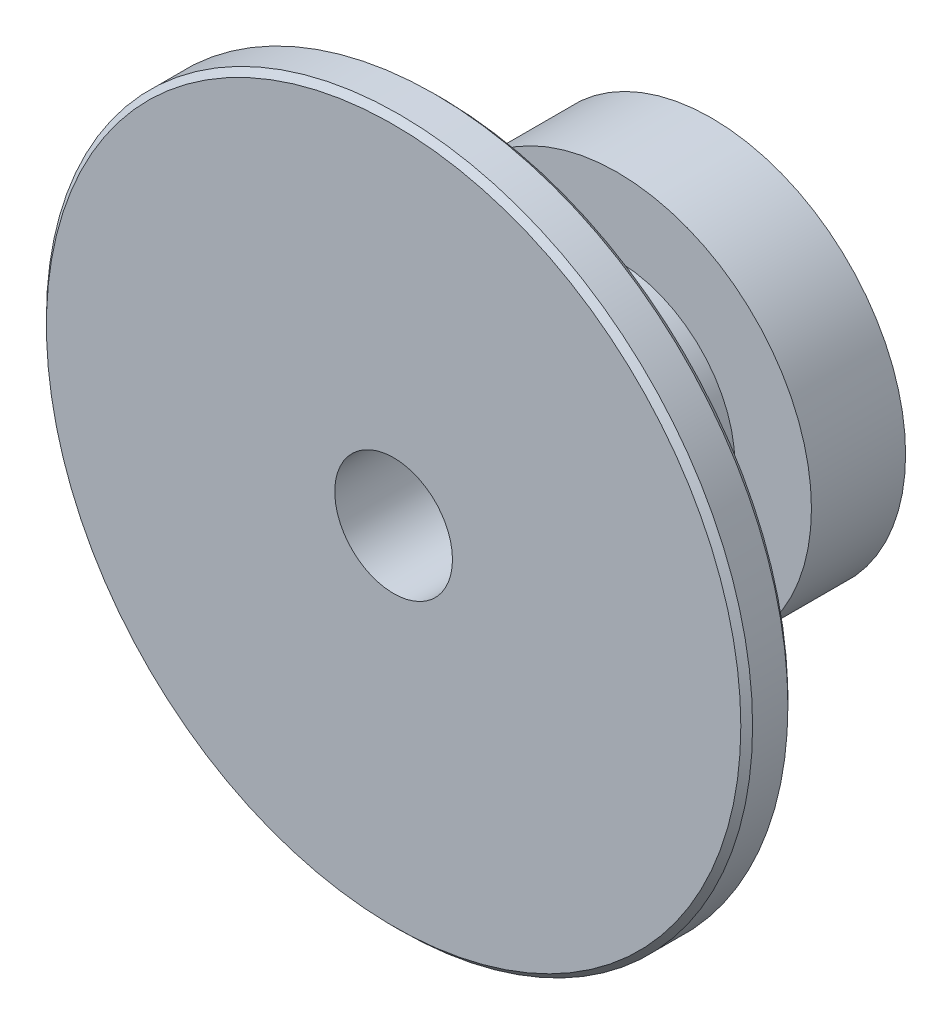
ISO-10303-21;
HEADER;
FILE_DESCRIPTION(('STEP AP214'),'2;1');
FILE_NAME('part.step','',(''),(''),'','','');
FILE_SCHEMA(('AUTOMOTIVE_DESIGN { 1 0 10303 214 1 1 1 1 }'));
ENDSEC;
DATA;
#1=APPLICATION_CONTEXT('core data for automotive mechanical design processes');
#2=APPLICATION_PROTOCOL_DEFINITION('international standard','automotive_design',2000,#1);
#3=PRODUCT_CONTEXT('',#1,'mechanical');
#4=PRODUCT('Part','Part','',(#3));
#5=PRODUCT_RELATED_PRODUCT_CATEGORY('part','',(#4));
#6=PRODUCT_DEFINITION_FORMATION('','',#4);
#7=PRODUCT_DEFINITION_CONTEXT('part definition',#1,'design');
#8=PRODUCT_DEFINITION('design','',#6,#7);
#9=PRODUCT_DEFINITION_SHAPE('','',#8);
#10=(LENGTH_UNIT() NAMED_UNIT(*) SI_UNIT(.MILLI.,.METRE.));
#11=(NAMED_UNIT(*) PLANE_ANGLE_UNIT() SI_UNIT($,.RADIAN.));
#12=(NAMED_UNIT(*) SI_UNIT($,.STERADIAN.) SOLID_ANGLE_UNIT());
#13=UNCERTAINTY_MEASURE_WITH_UNIT(LENGTH_MEASURE(1.E-05),#10,'distance_accuracy_value','');
#14=(GEOMETRIC_REPRESENTATION_CONTEXT(3) GLOBAL_UNCERTAINTY_ASSIGNED_CONTEXT((#13)) GLOBAL_UNIT_ASSIGNED_CONTEXT((#10,
#11,#12)) REPRESENTATION_CONTEXT('',''));
#15=CARTESIAN_POINT('',(0.,0.,0.));
#16=DIRECTION('',(0.,0.,1.));
#17=DIRECTION('',(1.,0.,0.));
#18=AXIS2_PLACEMENT_3D('',#15,#16,#17);
#19=CARTESIAN_POINT('',(0.,0.,17.8725165562914));
#20=DIRECTION('',(0.,0.,1.));
#21=DIRECTION('',(1.,0.,0.));
#22=AXIS2_PLACEMENT_3D('',#19,#20,#21);
#23=CYLINDRICAL_SURFACE('',#22,15.);
#24=CARTESIAN_POINT('',(0.,0.,-0.250000000000011));
#25=DIRECTION('',(0.,0.,1.));
#26=DIRECTION('',(1.,0.,0.));
#27=AXIS2_PLACEMENT_3D('',#24,#25,#26);
#28=CIRCLE('',#27,15.);
#29=CARTESIAN_POINT('',(15.,0.,-0.250000000000011));
#30=VERTEX_POINT('',#29);
#31=EDGE_CURVE('E40',#30,#30,#28,.F.);
#32=ORIENTED_EDGE('',*,*,#31,.T.);
#33=EDGE_LOOP('',(#32));
#34=FACE_BOUND('',#33,.T.);
#35=CARTESIAN_POINT('',(0.,0.,-1.75000000000001));
#36=DIRECTION('',(0.,0.,-1.));
#37=DIRECTION('',(-1.,0.,0.));
#38=AXIS2_PLACEMENT_3D('',#35,#36,#37);
#39=CIRCLE('',#38,15.);
#40=CARTESIAN_POINT('',(-15.,0.,-1.75000000000001));
#41=VERTEX_POINT('',#40);
#42=EDGE_CURVE('E44',#41,#41,#39,.F.);
#43=ORIENTED_EDGE('',*,*,#42,.T.);
#44=EDGE_LOOP('',(#43));
#45=FACE_BOUND('',#44,.T.);
#46=ADVANCED_FACE('F29',(#34,#45),#23,.T.);
#47=CARTESIAN_POINT('',(6.,0.,0.));
#48=DIRECTION('',(0.,0.,1.));
#49=DIRECTION('',(1.,0.,0.));
#50=AXIS2_PLACEMENT_3D('',#47,#48,#49);
#51=PLANE('',#50);
#52=CARTESIAN_POINT('',(0.,0.,0.));
#53=DIRECTION('',(0.,0.,1.));
#54=DIRECTION('',(1.,0.,0.));
#55=AXIS2_PLACEMENT_3D('',#52,#53,#54);
#56=CIRCLE('',#55,2.5);
#57=CARTESIAN_POINT('',(2.5,0.,0.));
#58=VERTEX_POINT('',#57);
#59=EDGE_CURVE('E58',#58,#58,#56,.T.);
#60=ORIENTED_EDGE('',*,*,#59,.F.);
#61=EDGE_LOOP('',(#60));
#62=FACE_BOUND('',#61,.T.);
#63=CARTESIAN_POINT('',(0.,0.,0.));
#64=DIRECTION('',(0.,0.,1.));
#65=DIRECTION('',(1.,0.,0.));
#66=AXIS2_PLACEMENT_3D('',#63,#64,#65);
#67=CIRCLE('',#66,14.75);
#68=CARTESIAN_POINT('',(14.75,0.,0.));
#69=VERTEX_POINT('',#68);
#70=EDGE_CURVE('E49',#69,#69,#67,.T.);
#71=ORIENTED_EDGE('',*,*,#70,.T.);
#72=EDGE_LOOP('',(#71));
#73=FACE_BOUND('',#72,.T.);
#74=ADVANCED_FACE('F90',(#62,#73),#51,.T.);
#75=CARTESIAN_POINT('',(0.,0.,-6.5));
#76=DIRECTION('',(0.,0.,-1.));
#77=DIRECTION('',(-1.,0.,0.));
#78=AXIS2_PLACEMENT_3D('',#75,#76,#77);
#79=PLANE('',#78);
#80=CARTESIAN_POINT('',(0.,0.,-6.5));
#81=DIRECTION('',(0.,0.,-1.));
#82=DIRECTION('',(-1.,0.,0.));
#83=AXIS2_PLACEMENT_3D('',#80,#81,#82);
#84=CIRCLE('',#83,5.);
#85=CARTESIAN_POINT('',(-5.,0.,-6.5));
#86=VERTEX_POINT('',#85);
#87=EDGE_CURVE('E10',#86,#86,#84,.T.);
#88=ORIENTED_EDGE('',*,*,#87,.F.);
#89=EDGE_LOOP('',(#88));
#90=FACE_BOUND('',#89,.T.);
#91=CARTESIAN_POINT('',(0.,0.,-6.5));
#92=DIRECTION('',(0.,0.,1.));
#93=DIRECTION('',(1.,0.,0.));
#94=AXIS2_PLACEMENT_3D('',#91,#92,#93);
#95=CIRCLE('',#94,8.25);
#96=CARTESIAN_POINT('',(8.25,0.,-6.5));
#97=VERTEX_POINT('',#96);
#98=EDGE_CURVE('E52',#97,#97,#95,.T.);
#99=ORIENTED_EDGE('',*,*,#98,.F.);
#100=EDGE_LOOP('',(#99));
#101=FACE_BOUND('',#100,.T.);
#102=ADVANCED_FACE('F96',(#90,#101),#79,.T.);
#103=CARTESIAN_POINT('',(0.,0.,17.8725165562914));
#104=DIRECTION('',(0.,0.,1.));
#105=DIRECTION('',(1.,0.,0.));
#106=AXIS2_PLACEMENT_3D('',#103,#104,#105);
#107=CYLINDRICAL_SURFACE('',#106,8.25);
#108=ORIENTED_EDGE('',*,*,#98,.T.);
#109=EDGE_LOOP('',(#108));
#110=FACE_BOUND('',#109,.T.);
#111=CARTESIAN_POINT('',(0.,0.,-2.));
#112=DIRECTION('',(0.,0.,1.));
#113=DIRECTION('',(1.,0.,0.));
#114=AXIS2_PLACEMENT_3D('',#111,#112,#113);
#115=CIRCLE('',#114,8.25);
#116=CARTESIAN_POINT('',(8.25,0.,-2.));
#117=VERTEX_POINT('',#116);
#118=EDGE_CURVE('E55',#117,#117,#115,.T.);
#119=ORIENTED_EDGE('',*,*,#118,.F.);
#120=EDGE_LOOP('',(#119));
#121=FACE_BOUND('',#120,.T.);
#122=ADVANCED_FACE('F111',(#110,#121),#107,.T.);
#123=CARTESIAN_POINT('',(15.,0.,-2.));
#124=DIRECTION('',(0.,0.,-1.));
#125=DIRECTION('',(-1.,0.,0.));
#126=AXIS2_PLACEMENT_3D('',#123,#124,#125);
#127=PLANE('',#126);
#128=CARTESIAN_POINT('',(0.,0.,-2.));
#129=DIRECTION('',(0.,0.,-1.));
#130=DIRECTION('',(-1.,0.,0.));
#131=AXIS2_PLACEMENT_3D('',#128,#129,#130);
#132=CIRCLE('',#131,14.75);
#133=CARTESIAN_POINT('',(-14.75,0.,-2.));
#134=VERTEX_POINT('',#133);
#135=EDGE_CURVE('E36',#134,#134,#132,.T.);
#136=ORIENTED_EDGE('',*,*,#135,.T.);
#137=EDGE_LOOP('',(#136));
#138=FACE_BOUND('',#137,.T.);
#139=ORIENTED_EDGE('',*,*,#118,.T.);
#140=EDGE_LOOP('',(#139));
#141=FACE_BOUND('',#140,.T.);
#142=ADVANCED_FACE('F103',(#138,#141),#127,.T.);
#143=CARTESIAN_POINT('',(0.,0.,0.));
#144=DIRECTION('',(0.,0.,-1.));
#145=DIRECTION('',(-1.,0.,0.));
#146=AXIS2_PLACEMENT_3D('',#143,#144,#145);
#147=CONICAL_SURFACE('',#146,14.75,0.785398163397448);
#148=ORIENTED_EDGE('',*,*,#31,.F.);
#149=EDGE_LOOP('',(#148));
#150=FACE_BOUND('',#149,.T.);
#151=ORIENTED_EDGE('',*,*,#70,.F.);
#152=EDGE_LOOP('',(#151));
#153=FACE_BOUND('',#152,.T.);
#154=ADVANCED_FACE('F101',(#150,#153),#147,.T.);
#155=CARTESIAN_POINT('',(0.,0.,-1.75000000000001));
#156=DIRECTION('',(0.,0.,1.));
#157=DIRECTION('',(1.,0.,0.));
#158=AXIS2_PLACEMENT_3D('',#155,#156,#157);
#159=CONICAL_SURFACE('',#158,15.,0.785398163397452);
#160=ORIENTED_EDGE('',*,*,#135,.F.);
#161=EDGE_LOOP('',(#160));
#162=FACE_BOUND('',#161,.T.);
#163=ORIENTED_EDGE('',*,*,#42,.F.);
#164=EDGE_LOOP('',(#163));
#165=FACE_BOUND('',#164,.T.);
#166=ADVANCED_FACE('F31',(#162,#165),#159,.T.);
#167=CARTESIAN_POINT('',(0.,0.,3.5));
#168=DIRECTION('',(0.,0.,-1.));
#169=DIRECTION('',(-1.,0.,0.));
#170=AXIS2_PLACEMENT_3D('',#167,#168,#169);
#171=CYLINDRICAL_SURFACE('',#170,2.5);
#172=ORIENTED_EDGE('',*,*,#59,.T.);
#173=EDGE_LOOP('',(#172));
#174=FACE_BOUND('',#173,.T.);
#175=CARTESIAN_POINT('',(0.,0.,-13.5));
#176=DIRECTION('',(0.,0.,1.));
#177=DIRECTION('',(1.,0.,0.));
#178=AXIS2_PLACEMENT_3D('',#175,#176,#177);
#179=CIRCLE('',#178,2.5);
#180=CARTESIAN_POINT('',(2.5,0.,-13.5));
#181=VERTEX_POINT('',#180);
#182=EDGE_CURVE('E61',#181,#181,#179,.T.);
#183=ORIENTED_EDGE('',*,*,#182,.F.);
#184=EDGE_LOOP('',(#183));
#185=FACE_BOUND('',#184,.T.);
#186=ADVANCED_FACE('F109',(#174,#185),#171,.F.);
#187=CARTESIAN_POINT('',(2.5,0.,-13.5));
#188=DIRECTION('',(0.,0.,-1.));
#189=DIRECTION('',(-1.,0.,0.));
#190=AXIS2_PLACEMENT_3D('',#187,#188,#189);
#191=PLANE('',#190);
#192=ORIENTED_EDGE('',*,*,#182,.T.);
#193=EDGE_LOOP('',(#192));
#194=FACE_BOUND('',#193,.T.);
#195=CARTESIAN_POINT('',(0.,0.,-13.5));
#196=DIRECTION('',(0.,0.,1.));
#197=DIRECTION('',(1.,0.,0.));
#198=AXIS2_PLACEMENT_3D('',#195,#196,#197);
#199=CIRCLE('',#198,8.25);
#200=CARTESIAN_POINT('',(8.25,0.,-13.5));
#201=VERTEX_POINT('',#200);
#202=EDGE_CURVE('E64',#201,#201,#199,.T.);
#203=ORIENTED_EDGE('',*,*,#202,.F.);
#204=EDGE_LOOP('',(#203));
#205=FACE_BOUND('',#204,.T.);
#206=ADVANCED_FACE('F86',(#194,#205),#191,.T.);
#207=CARTESIAN_POINT('',(0.,0.,0.));
#208=DIRECTION('',(0.,0.,1.));
#209=DIRECTION('',(1.,0.,0.));
#210=AXIS2_PLACEMENT_3D('',#207,#208,#209);
#211=CYLINDRICAL_SURFACE('',#210,8.25);
#212=ORIENTED_EDGE('',*,*,#202,.T.);
#213=EDGE_LOOP('',(#212));
#214=FACE_BOUND('',#213,.T.);
#215=CARTESIAN_POINT('',(0.,0.,-9.5));
#216=DIRECTION('',(0.,0.,1.));
#217=DIRECTION('',(1.,0.,0.));
#218=AXIS2_PLACEMENT_3D('',#215,#216,#217);
#219=CIRCLE('',#218,8.25);
#220=CARTESIAN_POINT('',(8.25,0.,-9.5));
#221=VERTEX_POINT('',#220);
#222=EDGE_CURVE('E67',#221,#221,#219,.T.);
#223=ORIENTED_EDGE('',*,*,#222,.F.);
#224=EDGE_LOOP('',(#223));
#225=FACE_BOUND('',#224,.T.);
#226=ADVANCED_FACE('F78',(#214,#225),#211,.T.);
#227=CARTESIAN_POINT('',(8.25,0.,-9.5));
#228=DIRECTION('',(0.,0.,1.));
#229=DIRECTION('',(1.,0.,0.));
#230=AXIS2_PLACEMENT_3D('',#227,#228,#229);
#231=PLANE('',#230);
#232=ORIENTED_EDGE('',*,*,#222,.T.);
#233=EDGE_LOOP('',(#232));
#234=FACE_BOUND('',#233,.T.);
#235=CARTESIAN_POINT('',(0.,0.,-9.5));
#236=DIRECTION('',(0.,0.,1.));
#237=DIRECTION('',(1.,0.,0.));
#238=AXIS2_PLACEMENT_3D('',#235,#236,#237);
#239=CIRCLE('',#238,5.);
#240=CARTESIAN_POINT('',(5.,0.,-9.5));
#241=VERTEX_POINT('',#240);
#242=EDGE_CURVE('E70',#241,#241,#239,.T.);
#243=ORIENTED_EDGE('',*,*,#242,.F.);
#244=EDGE_LOOP('',(#243));
#245=FACE_BOUND('',#244,.T.);
#246=ADVANCED_FACE('F76',(#234,#245),#231,.T.);
#247=CARTESIAN_POINT('',(0.,0.,0.));
#248=DIRECTION('',(0.,0.,1.));
#249=DIRECTION('',(1.,0.,0.));
#250=AXIS2_PLACEMENT_3D('',#247,#248,#249);
#251=CYLINDRICAL_SURFACE('',#250,5.);
#252=ORIENTED_EDGE('',*,*,#87,.T.);
#253=EDGE_LOOP('',(#252));
#254=FACE_BOUND('',#253,.T.);
#255=ORIENTED_EDGE('',*,*,#242,.T.);
#256=EDGE_LOOP('',(#255));
#257=FACE_BOUND('',#256,.T.);
#258=ADVANCED_FACE('F74',(#254,#257),#251,.T.);
#259=CLOSED_SHELL('',(#46,#74,#102,#122,#142,#154,#166,#186,#206,#226,#246,#258));
#260=MANIFOLD_SOLID_BREP('B2',#259);
#261=ADVANCED_BREP_SHAPE_REPRESENTATION('',(#18,#260),#14);
#262=SHAPE_DEFINITION_REPRESENTATION(#9,#261);
ENDSEC;
END-ISO-10303-21;
